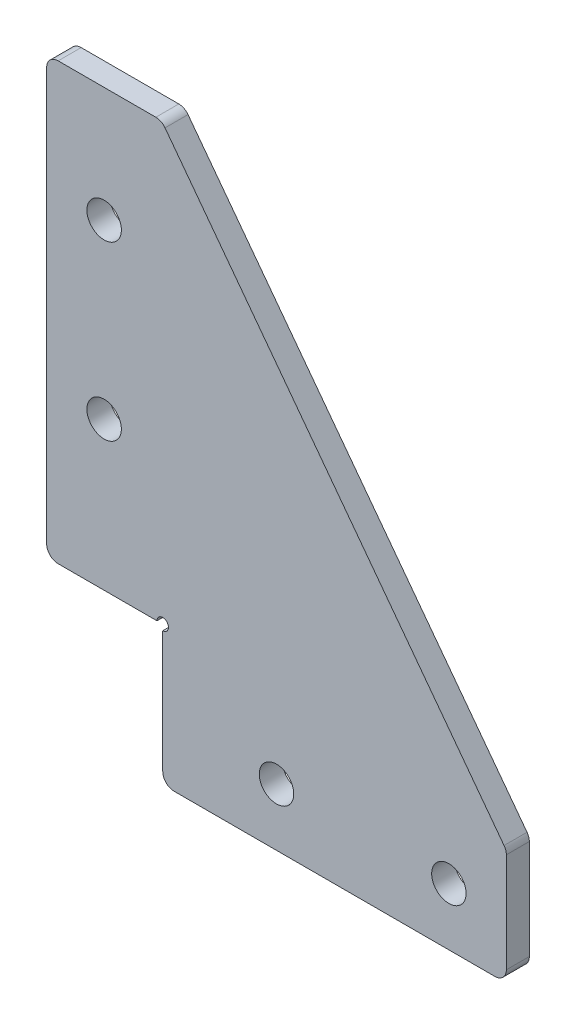
ISO-10303-21;
HEADER;
FILE_DESCRIPTION(('STEP AP214'),'2;1');
FILE_NAME('part.step','',(''),(''),'','','');
FILE_SCHEMA(('AUTOMOTIVE_DESIGN { 1 0 10303 214 1 1 1 1 }'));
ENDSEC;
DATA;
#1=APPLICATION_CONTEXT('core data for automotive mechanical design processes');
#2=APPLICATION_PROTOCOL_DEFINITION('international standard','automotive_design',2000,#1);
#3=PRODUCT_CONTEXT('',#1,'mechanical');
#4=PRODUCT('Part','Part','',(#3));
#5=PRODUCT_RELATED_PRODUCT_CATEGORY('part','',(#4));
#6=PRODUCT_DEFINITION_FORMATION('','',#4);
#7=PRODUCT_DEFINITION_CONTEXT('part definition',#1,'design');
#8=PRODUCT_DEFINITION('design','',#6,#7);
#9=PRODUCT_DEFINITION_SHAPE('','',#8);
#10=(LENGTH_UNIT() NAMED_UNIT(*) SI_UNIT(.MILLI.,.METRE.));
#11=(NAMED_UNIT(*) PLANE_ANGLE_UNIT() SI_UNIT($,.RADIAN.));
#12=(NAMED_UNIT(*) SI_UNIT($,.STERADIAN.) SOLID_ANGLE_UNIT());
#13=UNCERTAINTY_MEASURE_WITH_UNIT(LENGTH_MEASURE(1.E-05),#10,'distance_accuracy_value','');
#14=(GEOMETRIC_REPRESENTATION_CONTEXT(3) GLOBAL_UNCERTAINTY_ASSIGNED_CONTEXT((#13)) GLOBAL_UNIT_ASSIGNED_CONTEXT((#10,
#11,#12)) REPRESENTATION_CONTEXT('',''));
#15=CARTESIAN_POINT('',(0.,0.,0.));
#16=DIRECTION('',(0.,0.,1.));
#17=DIRECTION('',(1.,0.,0.));
#18=AXIS2_PLACEMENT_3D('',#15,#16,#17);
#19=CARTESIAN_POINT('',(0.,0.,2.));
#20=DIRECTION('',(0.,0.,-1.));
#21=DIRECTION('',(-1.,0.,0.));
#22=AXIS2_PLACEMENT_3D('',#19,#20,#21);
#23=PLANE('',#22);
#24=DIRECTION('',(-1.,0.,0.));
#25=VECTOR('',#24,1.);
#26=CARTESIAN_POINT('',(-5.,45.,2.));
#27=LINE('',#26,#25);
#28=CARTESIAN_POINT('',(4.50000000000001,45.,2.));
#29=VERTEX_POINT('',#28);
#30=CARTESIAN_POINT('',(-3.99999999999967,45.,2.));
#31=VERTEX_POINT('',#30);
#32=EDGE_CURVE('E207',#29,#31,#27,.T.);
#33=ORIENTED_EDGE('',*,*,#32,.T.);
#34=CARTESIAN_POINT('',(-3.99999999999967,44.,2.));
#35=DIRECTION('',(0.,0.,-1.));
#36=DIRECTION('',(-1.,0.,0.));
#37=AXIS2_PLACEMENT_3D('',#34,#35,#36);
#38=CIRCLE('',#37,1.);
#39=CARTESIAN_POINT('',(-5.,44.,2.));
#40=VERTEX_POINT('',#39);
#41=EDGE_CURVE('E256',#31,#40,#38,.F.);
#42=ORIENTED_EDGE('',*,*,#41,.T.);
#43=DIRECTION('',(0.,-1.,0.));
#44=VECTOR('',#43,1.);
#45=CARTESIAN_POINT('',(-4.99999999999995,15.,2.));
#46=LINE('',#45,#44);
#47=CARTESIAN_POINT('',(-4.99999999999994,8.10000000000001,2.));
#48=VERTEX_POINT('',#47);
#49=EDGE_CURVE('E155',#40,#48,#46,.T.);
#50=ORIENTED_EDGE('',*,*,#49,.T.);
#51=CARTESIAN_POINT('',(-4.00000000000002,8.1,2.));
#52=DIRECTION('',(0.,0.,-1.));
#53=DIRECTION('',(-1.,0.,0.));
#54=AXIS2_PLACEMENT_3D('',#51,#52,#53);
#55=CIRCLE('',#54,1.);
#56=CARTESIAN_POINT('',(-4.00000000000002,7.1,2.));
#57=VERTEX_POINT('',#56);
#58=EDGE_CURVE('E150',#48,#57,#55,.F.);
#59=ORIENTED_EDGE('',*,*,#58,.T.);
#60=DIRECTION('',(1.,0.,0.));
#61=VECTOR('',#60,1.);
#62=CARTESIAN_POINT('',(-5.00000000000002,7.1,2.));
#63=LINE('',#62,#61);
#64=CARTESIAN_POINT('',(4.59999999999999,7.09999999999999,2.));
#65=VERTEX_POINT('',#64);
#66=EDGE_CURVE('E141',#57,#65,#63,.T.);
#67=ORIENTED_EDGE('',*,*,#66,.T.);
#68=CARTESIAN_POINT('',(5.1,7.1,2.));
#69=DIRECTION('',(0.,0.,1.));
#70=DIRECTION('',(1.,0.,0.));
#71=AXIS2_PLACEMENT_3D('',#68,#69,#70);
#72=CIRCLE('',#71,0.500000000000001);
#73=CARTESIAN_POINT('',(5.09999999999997,6.59999999999999,2.));
#74=VERTEX_POINT('',#73);
#75=EDGE_CURVE('E146',#74,#65,#72,.T.);
#76=ORIENTED_EDGE('',*,*,#75,.F.);
#77=DIRECTION('',(0.,-1.,0.));
#78=VECTOR('',#77,1.);
#79=CARTESIAN_POINT('',(5.09999999999997,7.09999999999999,2.));
#80=LINE('',#79,#78);
#81=CARTESIAN_POINT('',(5.09999999999997,-4.,2.));
#82=VERTEX_POINT('',#81);
#83=EDGE_CURVE('E154',#74,#82,#80,.T.);
#84=ORIENTED_EDGE('',*,*,#83,.T.);
#85=CARTESIAN_POINT('',(6.09999999999997,-4.,2.));
#86=DIRECTION('',(0.,0.,-1.));
#87=DIRECTION('',(-1.,0.,0.));
#88=AXIS2_PLACEMENT_3D('',#85,#86,#87);
#89=CIRCLE('',#88,1.);
#90=CARTESIAN_POINT('',(6.09999999999997,-5.00000000000001,2.));
#91=VERTEX_POINT('',#90);
#92=EDGE_CURVE('E249',#82,#91,#89,.F.);
#93=ORIENTED_EDGE('',*,*,#92,.T.);
#94=DIRECTION('',(1.,0.,0.));
#95=VECTOR('',#94,1.);
#96=CARTESIAN_POINT('',(5.09999999999997,-5.00000000000001,2.));
#97=LINE('',#96,#95);
#98=CARTESIAN_POINT('',(34.,-5.,2.));
#99=VERTEX_POINT('',#98);
#100=EDGE_CURVE('E200',#91,#99,#97,.T.);
#101=ORIENTED_EDGE('',*,*,#100,.T.);
#102=CARTESIAN_POINT('',(34.,-4.,2.));
#103=DIRECTION('',(0.,0.,-1.));
#104=DIRECTION('',(-1.,0.,0.));
#105=AXIS2_PLACEMENT_3D('',#102,#103,#104);
#106=CIRCLE('',#105,1.);
#107=CARTESIAN_POINT('',(35.,-4.,2.));
#108=VERTEX_POINT('',#107);
#109=EDGE_CURVE('E251',#99,#108,#106,.F.);
#110=ORIENTED_EDGE('',*,*,#109,.T.);
#111=DIRECTION('',(0.,1.,0.));
#112=VECTOR('',#111,1.);
#113=CARTESIAN_POINT('',(35.,4.99999999999999,2.));
#114=LINE('',#113,#112);
#115=CARTESIAN_POINT('',(35.,4.66666666666666,2.));
#116=VERTEX_POINT('',#115);
#117=EDGE_CURVE('E203',#108,#116,#114,.T.);
#118=ORIENTED_EDGE('',*,*,#117,.T.);
#119=CARTESIAN_POINT('',(34.,4.66666666666666,2.));
#120=DIRECTION('',(0.,0.,-1.));
#121=DIRECTION('',(-1.,0.,0.));
#122=AXIS2_PLACEMENT_3D('',#119,#120,#121);
#123=CIRCLE('',#122,1.);
#124=CARTESIAN_POINT('',(34.8,5.26666666666666,2.));
#125=VERTEX_POINT('',#124);
#126=EDGE_CURVE('E61',#116,#125,#123,.F.);
#127=ORIENTED_EDGE('',*,*,#126,.T.);
#128=DIRECTION('',(-0.6,0.8,0.));
#129=VECTOR('',#128,1.);
#130=CARTESIAN_POINT('',(5.,45.,2.));
#131=LINE('',#130,#129);
#132=CARTESIAN_POINT('',(5.30000000000001,44.6,2.));
#133=VERTEX_POINT('',#132);
#134=EDGE_CURVE('E205',#125,#133,#131,.T.);
#135=ORIENTED_EDGE('',*,*,#134,.T.);
#136=CARTESIAN_POINT('',(4.50000000000001,44.,2.));
#137=DIRECTION('',(0.,0.,-1.));
#138=DIRECTION('',(-1.,0.,0.));
#139=AXIS2_PLACEMENT_3D('',#136,#137,#138);
#140=CIRCLE('',#139,1.);
#141=EDGE_CURVE('E254',#133,#29,#140,.F.);
#142=ORIENTED_EDGE('',*,*,#141,.T.);
#143=EDGE_LOOP('',(#33,#42,#50,#59,#67,#76,#84,#93,#101,#110,#118,#127,#135,#142));
#144=FACE_BOUND('',#143,.T.);
#145=CARTESIAN_POINT('',(0.,35.,2.));
#146=DIRECTION('',(0.,0.,1.));
#147=DIRECTION('',(1.,0.,0.));
#148=AXIS2_PLACEMENT_3D('',#145,#146,#147);
#149=CIRCLE('',#148,1.50000000000002);
#150=CARTESIAN_POINT('',(1.50000000000002,35.,2.));
#151=VERTEX_POINT('',#150);
#152=EDGE_CURVE('E191',#151,#151,#149,.T.);
#153=ORIENTED_EDGE('',*,*,#152,.F.);
#154=EDGE_LOOP('',(#153));
#155=FACE_BOUND('',#154,.T.);
#156=CARTESIAN_POINT('',(30.0000000000001,0.,2.));
#157=DIRECTION('',(0.,0.,1.));
#158=DIRECTION('',(1.,0.,0.));
#159=AXIS2_PLACEMENT_3D('',#156,#157,#158);
#160=CIRCLE('',#159,1.50000000000003);
#161=CARTESIAN_POINT('',(31.5000000000001,0.,2.));
#162=VERTEX_POINT('',#161);
#163=EDGE_CURVE('E185',#162,#162,#160,.T.);
#164=ORIENTED_EDGE('',*,*,#163,.F.);
#165=EDGE_LOOP('',(#164));
#166=FACE_BOUND('',#165,.T.);
#167=CARTESIAN_POINT('',(0.,20.,2.));
#168=DIRECTION('',(0.,0.,1.));
#169=DIRECTION('',(1.,0.,0.));
#170=AXIS2_PLACEMENT_3D('',#167,#168,#169);
#171=CIRCLE('',#170,1.50000000000002);
#172=CARTESIAN_POINT('',(1.50000000000002,20.,2.));
#173=VERTEX_POINT('',#172);
#174=EDGE_CURVE('E179',#173,#173,#171,.T.);
#175=ORIENTED_EDGE('',*,*,#174,.F.);
#176=EDGE_LOOP('',(#175));
#177=FACE_BOUND('',#176,.T.);
#178=CARTESIAN_POINT('',(15.0000000000001,0.,2.));
#179=DIRECTION('',(0.,0.,1.));
#180=DIRECTION('',(1.,0.,0.));
#181=AXIS2_PLACEMENT_3D('',#178,#179,#180);
#182=CIRCLE('',#181,1.50000000000003);
#183=CARTESIAN_POINT('',(16.5000000000001,0.,2.));
#184=VERTEX_POINT('',#183);
#185=EDGE_CURVE('E172',#184,#184,#182,.T.);
#186=ORIENTED_EDGE('',*,*,#185,.F.);
#187=EDGE_LOOP('',(#186));
#188=FACE_BOUND('',#187,.T.);
#189=ADVANCED_FACE('F39',(#144,#155,#166,#177,#188),#23,.F.);
#190=CARTESIAN_POINT('',(0.,0.,0.));
#191=DIRECTION('',(0.,0.,-1.));
#192=DIRECTION('',(-1.,0.,0.));
#193=AXIS2_PLACEMENT_3D('',#190,#191,#192);
#194=PLANE('',#193);
#195=DIRECTION('',(0.,-1.,0.));
#196=VECTOR('',#195,1.);
#197=CARTESIAN_POINT('',(-4.99999999999995,15.,0.));
#198=LINE('',#197,#196);
#199=CARTESIAN_POINT('',(-4.99999999999967,44.,0.));
#200=VERTEX_POINT('',#199);
#201=CARTESIAN_POINT('',(-5.00000000000002,8.10000000000001,0.));
#202=VERTEX_POINT('',#201);
#203=EDGE_CURVE('E194',#200,#202,#198,.T.);
#204=ORIENTED_EDGE('',*,*,#203,.F.);
#205=CARTESIAN_POINT('',(-3.99999999999967,44.,0.));
#206=DIRECTION('',(0.,0.,-1.));
#207=DIRECTION('',(-1.,0.,0.));
#208=AXIS2_PLACEMENT_3D('',#205,#206,#207);
#209=CIRCLE('',#208,1.);
#210=CARTESIAN_POINT('',(-3.99999999999967,45.,0.));
#211=VERTEX_POINT('',#210);
#212=EDGE_CURVE('E241',#200,#211,#209,.T.);
#213=ORIENTED_EDGE('',*,*,#212,.T.);
#214=DIRECTION('',(-1.,0.,0.));
#215=VECTOR('',#214,1.);
#216=CARTESIAN_POINT('',(-5.,45.,0.));
#217=LINE('',#216,#215);
#218=CARTESIAN_POINT('',(4.50000000000001,45.,0.));
#219=VERTEX_POINT('',#218);
#220=EDGE_CURVE('E197',#219,#211,#217,.T.);
#221=ORIENTED_EDGE('',*,*,#220,.F.);
#222=CARTESIAN_POINT('',(4.50000000000001,44.,0.));
#223=DIRECTION('',(0.,0.,-1.));
#224=DIRECTION('',(-1.,0.,0.));
#225=AXIS2_PLACEMENT_3D('',#222,#223,#224);
#226=CIRCLE('',#225,1.);
#227=CARTESIAN_POINT('',(5.30000000000001,44.6,0.));
#228=VERTEX_POINT('',#227);
#229=EDGE_CURVE('E239',#219,#228,#226,.T.);
#230=ORIENTED_EDGE('',*,*,#229,.T.);
#231=DIRECTION('',(-0.6,0.8,0.));
#232=VECTOR('',#231,1.);
#233=CARTESIAN_POINT('',(5.,45.,0.));
#234=LINE('',#233,#232);
#235=CARTESIAN_POINT('',(34.8,5.26666666666666,0.));
#236=VERTEX_POINT('',#235);
#237=EDGE_CURVE('E221',#236,#228,#234,.T.);
#238=ORIENTED_EDGE('',*,*,#237,.F.);
#239=CARTESIAN_POINT('',(34.,4.66666666666666,0.));
#240=DIRECTION('',(0.,0.,-1.));
#241=DIRECTION('',(-1.,0.,0.));
#242=AXIS2_PLACEMENT_3D('',#239,#240,#241);
#243=CIRCLE('',#242,1.);
#244=CARTESIAN_POINT('',(35.,4.66666666666666,0.));
#245=VERTEX_POINT('',#244);
#246=EDGE_CURVE('E237',#236,#245,#243,.T.);
#247=ORIENTED_EDGE('',*,*,#246,.T.);
#248=DIRECTION('',(0.,1.,0.));
#249=VECTOR('',#248,1.);
#250=CARTESIAN_POINT('',(35.,4.99999999999999,0.));
#251=LINE('',#250,#249);
#252=CARTESIAN_POINT('',(35.,-4.,0.));
#253=VERTEX_POINT('',#252);
#254=EDGE_CURVE('E218',#253,#245,#251,.T.);
#255=ORIENTED_EDGE('',*,*,#254,.F.);
#256=CARTESIAN_POINT('',(34.,-4.,0.));
#257=DIRECTION('',(0.,0.,-1.));
#258=DIRECTION('',(-1.,0.,0.));
#259=AXIS2_PLACEMENT_3D('',#256,#257,#258);
#260=CIRCLE('',#259,1.);
#261=CARTESIAN_POINT('',(34.,-5.,0.));
#262=VERTEX_POINT('',#261);
#263=EDGE_CURVE('E235',#253,#262,#260,.T.);
#264=ORIENTED_EDGE('',*,*,#263,.T.);
#265=DIRECTION('',(1.,0.,0.));
#266=VECTOR('',#265,1.);
#267=CARTESIAN_POINT('',(35.,-5.,0.));
#268=LINE('',#267,#266);
#269=CARTESIAN_POINT('',(6.09999999999997,-5.,0.));
#270=VERTEX_POINT('',#269);
#271=EDGE_CURVE('E215',#270,#262,#268,.T.);
#272=ORIENTED_EDGE('',*,*,#271,.F.);
#273=CARTESIAN_POINT('',(6.09999999999997,-4.,0.));
#274=DIRECTION('',(0.,0.,-1.));
#275=DIRECTION('',(-1.,0.,0.));
#276=AXIS2_PLACEMENT_3D('',#273,#274,#275);
#277=CIRCLE('',#276,1.);
#278=CARTESIAN_POINT('',(5.09999999999997,-4.,0.));
#279=VERTEX_POINT('',#278);
#280=EDGE_CURVE('E233',#270,#279,#277,.T.);
#281=ORIENTED_EDGE('',*,*,#280,.T.);
#282=DIRECTION('',(0.,-1.,0.));
#283=VECTOR('',#282,1.);
#284=CARTESIAN_POINT('',(5.09999999999997,7.09999999999999,0.));
#285=LINE('',#284,#283);
#286=CARTESIAN_POINT('',(5.09999999999997,6.59999999999999,0.));
#287=VERTEX_POINT('',#286);
#288=EDGE_CURVE('E212',#287,#279,#285,.T.);
#289=ORIENTED_EDGE('',*,*,#288,.F.);
#290=CARTESIAN_POINT('',(5.1,7.1,0.));
#291=DIRECTION('',(0.,0.,-1.));
#292=DIRECTION('',(-1.,0.,0.));
#293=AXIS2_PLACEMENT_3D('',#290,#291,#292);
#294=CIRCLE('',#293,0.500000000000001);
#295=CARTESIAN_POINT('',(4.59999999999999,7.09999999999999,0.));
#296=VERTEX_POINT('',#295);
#297=EDGE_CURVE('E164',#296,#287,#294,.T.);
#298=ORIENTED_EDGE('',*,*,#297,.F.);
#299=DIRECTION('',(1.,0.,0.));
#300=VECTOR('',#299,1.);
#301=CARTESIAN_POINT('',(-5.00000000000002,7.1,0.));
#302=LINE('',#301,#300);
#303=CARTESIAN_POINT('',(-4.00000000000002,7.1,0.));
#304=VERTEX_POINT('',#303);
#305=EDGE_CURVE('E168',#304,#296,#302,.T.);
#306=ORIENTED_EDGE('',*,*,#305,.F.);
#307=CARTESIAN_POINT('',(-4.00000000000002,8.1,0.));
#308=DIRECTION('',(0.,0.,-1.));
#309=DIRECTION('',(-1.,0.,0.));
#310=AXIS2_PLACEMENT_3D('',#307,#308,#309);
#311=CIRCLE('',#310,1.);
#312=EDGE_CURVE('E231',#304,#202,#311,.T.);
#313=ORIENTED_EDGE('',*,*,#312,.T.);
#314=EDGE_LOOP('',(#204,#213,#221,#230,#238,#247,#255,#264,#272,#281,#289,#298,#306,#313));
#315=FACE_BOUND('',#314,.T.);
#316=CARTESIAN_POINT('',(0.,20.,0.));
#317=DIRECTION('',(0.,0.,1.));
#318=DIRECTION('',(1.,0.,0.));
#319=AXIS2_PLACEMENT_3D('',#316,#317,#318);
#320=CIRCLE('',#319,1.50000000000002);
#321=CARTESIAN_POINT('',(1.50000000000002,20.,0.));
#322=VERTEX_POINT('',#321);
#323=EDGE_CURVE('E177',#322,#322,#320,.T.);
#324=ORIENTED_EDGE('',*,*,#323,.T.);
#325=EDGE_LOOP('',(#324));
#326=FACE_BOUND('',#325,.T.);
#327=CARTESIAN_POINT('',(0.,35.,0.));
#328=DIRECTION('',(0.,0.,1.));
#329=DIRECTION('',(1.,0.,0.));
#330=AXIS2_PLACEMENT_3D('',#327,#328,#329);
#331=CIRCLE('',#330,1.50000000000002);
#332=CARTESIAN_POINT('',(1.50000000000002,35.,0.));
#333=VERTEX_POINT('',#332);
#334=EDGE_CURVE('E188',#333,#333,#331,.T.);
#335=ORIENTED_EDGE('',*,*,#334,.T.);
#336=EDGE_LOOP('',(#335));
#337=FACE_BOUND('',#336,.T.);
#338=CARTESIAN_POINT('',(30.0000000000001,0.,0.));
#339=DIRECTION('',(0.,0.,1.));
#340=DIRECTION('',(1.,0.,0.));
#341=AXIS2_PLACEMENT_3D('',#338,#339,#340);
#342=CIRCLE('',#341,1.50000000000003);
#343=CARTESIAN_POINT('',(31.5000000000001,0.,0.));
#344=VERTEX_POINT('',#343);
#345=EDGE_CURVE('E182',#344,#344,#342,.T.);
#346=ORIENTED_EDGE('',*,*,#345,.T.);
#347=EDGE_LOOP('',(#346));
#348=FACE_BOUND('',#347,.T.);
#349=CARTESIAN_POINT('',(15.0000000000001,0.,0.));
#350=DIRECTION('',(0.,0.,1.));
#351=DIRECTION('',(1.,0.,0.));
#352=AXIS2_PLACEMENT_3D('',#349,#350,#351);
#353=CIRCLE('',#352,1.50000000000003);
#354=CARTESIAN_POINT('',(16.5000000000001,0.,0.));
#355=VERTEX_POINT('',#354);
#356=EDGE_CURVE('E169',#355,#355,#353,.T.);
#357=ORIENTED_EDGE('',*,*,#356,.T.);
#358=EDGE_LOOP('',(#357));
#359=FACE_BOUND('',#358,.T.);
#360=ADVANCED_FACE('F286',(#315,#326,#337,#348,#359),#194,.T.);
#361=CARTESIAN_POINT('',(-4.99999999999995,15.,2.));
#362=DIRECTION('',(1.,0.,0.));
#363=DIRECTION('',(0.,1.,0.));
#364=AXIS2_PLACEMENT_3D('',#361,#362,#363);
#365=PLANE('',#364);
#366=ORIENTED_EDGE('',*,*,#49,.F.);
#367=DIRECTION('',(0.,0.,-1.));
#368=VECTOR('',#367,1.);
#369=CARTESIAN_POINT('',(-4.99999999999967,44.,2.));
#370=LINE('',#369,#368);
#371=EDGE_CURVE('E228',#40,#200,#370,.T.);
#372=ORIENTED_EDGE('',*,*,#371,.T.);
#373=ORIENTED_EDGE('',*,*,#203,.T.);
#374=DIRECTION('',(0.,0.,-1.));
#375=VECTOR('',#374,1.);
#376=CARTESIAN_POINT('',(-5.00000000000002,8.10000000000001,2.));
#377=LINE('',#376,#375);
#378=EDGE_CURVE('E226',#202,#48,#377,.F.);
#379=ORIENTED_EDGE('',*,*,#378,.T.);
#380=EDGE_LOOP('',(#366,#372,#373,#379));
#381=FACE_BOUND('',#380,.T.);
#382=ADVANCED_FACE('F317',(#381),#365,.F.);
#383=CARTESIAN_POINT('',(-5.00000000000002,7.1,2.));
#384=DIRECTION('',(0.,1.,0.));
#385=DIRECTION('',(-1.,0.,0.));
#386=AXIS2_PLACEMENT_3D('',#383,#384,#385);
#387=PLANE('',#386);
#388=ORIENTED_EDGE('',*,*,#66,.F.);
#389=DIRECTION('',(0.,0.,-1.));
#390=VECTOR('',#389,1.);
#391=CARTESIAN_POINT('',(-4.00000000000002,7.1,2.));
#392=LINE('',#391,#390);
#393=EDGE_CURVE('E11',#57,#304,#392,.T.);
#394=ORIENTED_EDGE('',*,*,#393,.T.);
#395=ORIENTED_EDGE('',*,*,#305,.T.);
#396=DIRECTION('',(0.,0.,1.));
#397=VECTOR('',#396,1.);
#398=CARTESIAN_POINT('',(4.59999999999999,7.09999999999999,-8.));
#399=LINE('',#398,#397);
#400=EDGE_CURVE('E160',#296,#65,#399,.T.);
#401=ORIENTED_EDGE('',*,*,#400,.T.);
#402=EDGE_LOOP('',(#388,#394,#395,#401));
#403=FACE_BOUND('',#402,.T.);
#404=ADVANCED_FACE('F166',(#403),#387,.F.);
#405=CARTESIAN_POINT('',(5.09999999999997,7.09999999999999,2.));
#406=DIRECTION('',(1.,0.,0.));
#407=DIRECTION('',(0.,1.,0.));
#408=AXIS2_PLACEMENT_3D('',#405,#406,#407);
#409=PLANE('',#408);
#410=ORIENTED_EDGE('',*,*,#288,.T.);
#411=DIRECTION('',(0.,0.,-1.));
#412=VECTOR('',#411,1.);
#413=CARTESIAN_POINT('',(5.09999999999997,-4.,2.));
#414=LINE('',#413,#412);
#415=EDGE_CURVE('E47',#279,#82,#414,.F.);
#416=ORIENTED_EDGE('',*,*,#415,.T.);
#417=ORIENTED_EDGE('',*,*,#83,.F.);
#418=DIRECTION('',(0.,0.,1.));
#419=VECTOR('',#418,1.);
#420=CARTESIAN_POINT('',(5.09999999999997,6.59999999999999,-8.));
#421=LINE('',#420,#419);
#422=EDGE_CURVE('E163',#74,#287,#421,.F.);
#423=ORIENTED_EDGE('',*,*,#422,.T.);
#424=EDGE_LOOP('',(#410,#416,#417,#423));
#425=FACE_BOUND('',#424,.T.);
#426=ADVANCED_FACE('F273',(#425),#409,.F.);
#427=CARTESIAN_POINT('',(35.,-5.,2.));
#428=DIRECTION('',(0.,1.,0.));
#429=DIRECTION('',(0.,0.,1.));
#430=AXIS2_PLACEMENT_3D('',#427,#428,#429);
#431=PLANE('',#430);
#432=ORIENTED_EDGE('',*,*,#271,.T.);
#433=DIRECTION('',(0.,0.,-1.));
#434=VECTOR('',#433,1.);
#435=CARTESIAN_POINT('',(34.,-5.,2.));
#436=LINE('',#435,#434);
#437=EDGE_CURVE('E270',#262,#99,#436,.F.);
#438=ORIENTED_EDGE('',*,*,#437,.T.);
#439=ORIENTED_EDGE('',*,*,#100,.F.);
#440=DIRECTION('',(0.,0.,-1.));
#441=VECTOR('',#440,1.);
#442=CARTESIAN_POINT('',(6.09999999999997,-5.,2.));
#443=LINE('',#442,#441);
#444=EDGE_CURVE('E267',#91,#270,#443,.T.);
#445=ORIENTED_EDGE('',*,*,#444,.T.);
#446=EDGE_LOOP('',(#432,#438,#439,#445));
#447=FACE_BOUND('',#446,.T.);
#448=ADVANCED_FACE('F282',(#447),#431,.F.);
#449=CARTESIAN_POINT('',(35.,4.99999999999999,2.));
#450=DIRECTION('',(-1.,0.,0.));
#451=DIRECTION('',(0.,0.,1.));
#452=AXIS2_PLACEMENT_3D('',#449,#450,#451);
#453=PLANE('',#452);
#454=ORIENTED_EDGE('',*,*,#254,.T.);
#455=DIRECTION('',(0.,0.,-1.));
#456=VECTOR('',#455,1.);
#457=CARTESIAN_POINT('',(35.,4.66666666666666,2.));
#458=LINE('',#457,#456);
#459=EDGE_CURVE('E265',#245,#116,#458,.F.);
#460=ORIENTED_EDGE('',*,*,#459,.T.);
#461=ORIENTED_EDGE('',*,*,#117,.F.);
#462=DIRECTION('',(0.,0.,-1.));
#463=VECTOR('',#462,1.);
#464=CARTESIAN_POINT('',(35.,-4.,2.));
#465=LINE('',#464,#463);
#466=EDGE_CURVE('E262',#108,#253,#465,.T.);
#467=ORIENTED_EDGE('',*,*,#466,.T.);
#468=EDGE_LOOP('',(#454,#460,#461,#467));
#469=FACE_BOUND('',#468,.T.);
#470=ADVANCED_FACE('F295',(#469),#453,.F.);
#471=CARTESIAN_POINT('',(5.,45.,2.));
#472=DIRECTION('',(-0.8,-0.6,0.));
#473=DIRECTION('',(0.6,-0.8,0.));
#474=AXIS2_PLACEMENT_3D('',#471,#472,#473);
#475=PLANE('',#474);
#476=ORIENTED_EDGE('',*,*,#237,.T.);
#477=DIRECTION('',(0.,0.,-1.));
#478=VECTOR('',#477,1.);
#479=CARTESIAN_POINT('',(5.30000000000001,44.6,2.));
#480=LINE('',#479,#478);
#481=EDGE_CURVE('E54',#228,#133,#480,.F.);
#482=ORIENTED_EDGE('',*,*,#481,.T.);
#483=ORIENTED_EDGE('',*,*,#134,.F.);
#484=DIRECTION('',(0.,0.,-1.));
#485=VECTOR('',#484,1.);
#486=CARTESIAN_POINT('',(34.8,5.26666666666666,2.));
#487=LINE('',#486,#485);
#488=EDGE_CURVE('E258',#125,#236,#487,.T.);
#489=ORIENTED_EDGE('',*,*,#488,.T.);
#490=EDGE_LOOP('',(#476,#482,#483,#489));
#491=FACE_BOUND('',#490,.T.);
#492=ADVANCED_FACE('F301',(#491),#475,.F.);
#493=CARTESIAN_POINT('',(-5.,45.,2.));
#494=DIRECTION('',(0.,-1.,0.));
#495=DIRECTION('',(1.,0.,0.));
#496=AXIS2_PLACEMENT_3D('',#493,#494,#495);
#497=PLANE('',#496);
#498=ORIENTED_EDGE('',*,*,#220,.T.);
#499=DIRECTION('',(0.,0.,-1.));
#500=VECTOR('',#499,1.);
#501=CARTESIAN_POINT('',(-3.99999999999967,45.,2.));
#502=LINE('',#501,#500);
#503=EDGE_CURVE('E246',#211,#31,#502,.F.);
#504=ORIENTED_EDGE('',*,*,#503,.T.);
#505=ORIENTED_EDGE('',*,*,#32,.F.);
#506=DIRECTION('',(0.,0.,-1.));
#507=VECTOR('',#506,1.);
#508=CARTESIAN_POINT('',(4.50000000000001,45.,2.));
#509=LINE('',#508,#507);
#510=EDGE_CURVE('E243',#29,#219,#509,.T.);
#511=ORIENTED_EDGE('',*,*,#510,.T.);
#512=EDGE_LOOP('',(#498,#504,#505,#511));
#513=FACE_BOUND('',#512,.T.);
#514=ADVANCED_FACE('F309',(#513),#497,.F.);
#515=CARTESIAN_POINT('',(0.,35.,2.));
#516=DIRECTION('',(0.,0.,-1.));
#517=DIRECTION('',(-1.,0.,0.));
#518=AXIS2_PLACEMENT_3D('',#515,#516,#517);
#519=CYLINDRICAL_SURFACE('',#518,1.50000000000002);
#520=ORIENTED_EDGE('',*,*,#152,.T.);
#521=EDGE_LOOP('',(#520));
#522=FACE_BOUND('',#521,.T.);
#523=ORIENTED_EDGE('',*,*,#334,.F.);
#524=EDGE_LOOP('',(#523));
#525=FACE_BOUND('',#524,.T.);
#526=ADVANCED_FACE('F332',(#522,#525),#519,.F.);
#527=CARTESIAN_POINT('',(30.0000000000001,0.,2.));
#528=DIRECTION('',(0.,0.,-1.));
#529=DIRECTION('',(-1.,0.,0.));
#530=AXIS2_PLACEMENT_3D('',#527,#528,#529);
#531=CYLINDRICAL_SURFACE('',#530,1.50000000000003);
#532=ORIENTED_EDGE('',*,*,#163,.T.);
#533=EDGE_LOOP('',(#532));
#534=FACE_BOUND('',#533,.T.);
#535=ORIENTED_EDGE('',*,*,#345,.F.);
#536=EDGE_LOOP('',(#535));
#537=FACE_BOUND('',#536,.T.);
#538=ADVANCED_FACE('F420',(#534,#537),#531,.F.);
#539=CARTESIAN_POINT('',(0.,20.,2.));
#540=DIRECTION('',(0.,0.,-1.));
#541=DIRECTION('',(-1.,0.,0.));
#542=AXIS2_PLACEMENT_3D('',#539,#540,#541);
#543=CYLINDRICAL_SURFACE('',#542,1.50000000000002);
#544=ORIENTED_EDGE('',*,*,#174,.T.);
#545=EDGE_LOOP('',(#544));
#546=FACE_BOUND('',#545,.T.);
#547=ORIENTED_EDGE('',*,*,#323,.F.);
#548=EDGE_LOOP('',(#547));
#549=FACE_BOUND('',#548,.T.);
#550=ADVANCED_FACE('F410',(#546,#549),#543,.F.);
#551=CARTESIAN_POINT('',(15.0000000000001,0.,2.));
#552=DIRECTION('',(0.,0.,-1.));
#553=DIRECTION('',(-1.,0.,0.));
#554=AXIS2_PLACEMENT_3D('',#551,#552,#553);
#555=CYLINDRICAL_SURFACE('',#554,1.50000000000003);
#556=ORIENTED_EDGE('',*,*,#185,.T.);
#557=EDGE_LOOP('',(#556));
#558=FACE_BOUND('',#557,.T.);
#559=ORIENTED_EDGE('',*,*,#356,.F.);
#560=EDGE_LOOP('',(#559));
#561=FACE_BOUND('',#560,.T.);
#562=ADVANCED_FACE('F402',(#558,#561),#555,.F.);
#563=CARTESIAN_POINT('',(5.1,7.1,-8.));
#564=DIRECTION('',(0.,0.,1.));
#565=DIRECTION('',(1.,0.,0.));
#566=AXIS2_PLACEMENT_3D('',#563,#564,#565);
#567=CYLINDRICAL_SURFACE('',#566,0.500000000000001);
#568=ORIENTED_EDGE('',*,*,#297,.T.);
#569=ORIENTED_EDGE('',*,*,#422,.F.);
#570=ORIENTED_EDGE('',*,*,#75,.T.);
#571=ORIENTED_EDGE('',*,*,#400,.F.);
#572=EDGE_LOOP('',(#568,#569,#570,#571));
#573=FACE_BOUND('',#572,.T.);
#574=ADVANCED_FACE('F159',(#573),#567,.F.);
#575=CARTESIAN_POINT('',(-3.99999999999967,44.,2.));
#576=DIRECTION('',(0.,0.,-1.));
#577=DIRECTION('',(-1.,0.,0.));
#578=AXIS2_PLACEMENT_3D('',#575,#576,#577);
#579=CYLINDRICAL_SURFACE('',#578,1.);
#580=ORIENTED_EDGE('',*,*,#41,.F.);
#581=ORIENTED_EDGE('',*,*,#503,.F.);
#582=ORIENTED_EDGE('',*,*,#212,.F.);
#583=ORIENTED_EDGE('',*,*,#371,.F.);
#584=EDGE_LOOP('',(#580,#581,#582,#583));
#585=FACE_BOUND('',#584,.T.);
#586=ADVANCED_FACE('F315',(#585),#579,.T.);
#587=CARTESIAN_POINT('',(4.50000000000001,44.,2.));
#588=DIRECTION('',(0.,0.,-1.));
#589=DIRECTION('',(-1.,0.,0.));
#590=AXIS2_PLACEMENT_3D('',#587,#588,#589);
#591=CYLINDRICAL_SURFACE('',#590,1.);
#592=ORIENTED_EDGE('',*,*,#141,.F.);
#593=ORIENTED_EDGE('',*,*,#481,.F.);
#594=ORIENTED_EDGE('',*,*,#229,.F.);
#595=ORIENTED_EDGE('',*,*,#510,.F.);
#596=EDGE_LOOP('',(#592,#593,#594,#595));
#597=FACE_BOUND('',#596,.T.);
#598=ADVANCED_FACE('F306',(#597),#591,.T.);
#599=CARTESIAN_POINT('',(34.,4.66666666666666,2.));
#600=DIRECTION('',(0.,0.,-1.));
#601=DIRECTION('',(-1.,0.,0.));
#602=AXIS2_PLACEMENT_3D('',#599,#600,#601);
#603=CYLINDRICAL_SURFACE('',#602,1.);
#604=ORIENTED_EDGE('',*,*,#126,.F.);
#605=ORIENTED_EDGE('',*,*,#459,.F.);
#606=ORIENTED_EDGE('',*,*,#246,.F.);
#607=ORIENTED_EDGE('',*,*,#488,.F.);
#608=EDGE_LOOP('',(#604,#605,#606,#607));
#609=FACE_BOUND('',#608,.T.);
#610=ADVANCED_FACE('F299',(#609),#603,.T.);
#611=CARTESIAN_POINT('',(34.,-4.,2.));
#612=DIRECTION('',(0.,0.,-1.));
#613=DIRECTION('',(-1.,0.,0.));
#614=AXIS2_PLACEMENT_3D('',#611,#612,#613);
#615=CYLINDRICAL_SURFACE('',#614,1.);
#616=ORIENTED_EDGE('',*,*,#109,.F.);
#617=ORIENTED_EDGE('',*,*,#437,.F.);
#618=ORIENTED_EDGE('',*,*,#263,.F.);
#619=ORIENTED_EDGE('',*,*,#466,.F.);
#620=EDGE_LOOP('',(#616,#617,#618,#619));
#621=FACE_BOUND('',#620,.T.);
#622=ADVANCED_FACE('F292',(#621),#615,.T.);
#623=CARTESIAN_POINT('',(6.09999999999997,-4.,2.));
#624=DIRECTION('',(0.,0.,-1.));
#625=DIRECTION('',(-1.,0.,0.));
#626=AXIS2_PLACEMENT_3D('',#623,#624,#625);
#627=CYLINDRICAL_SURFACE('',#626,1.);
#628=ORIENTED_EDGE('',*,*,#92,.F.);
#629=ORIENTED_EDGE('',*,*,#415,.F.);
#630=ORIENTED_EDGE('',*,*,#280,.F.);
#631=ORIENTED_EDGE('',*,*,#444,.F.);
#632=EDGE_LOOP('',(#628,#629,#630,#631));
#633=FACE_BOUND('',#632,.T.);
#634=ADVANCED_FACE('F279',(#633),#627,.T.);
#635=CARTESIAN_POINT('',(-4.00000000000002,8.1,2.));
#636=DIRECTION('',(0.,0.,-1.));
#637=DIRECTION('',(-1.,0.,0.));
#638=AXIS2_PLACEMENT_3D('',#635,#636,#637);
#639=CYLINDRICAL_SURFACE('',#638,1.);
#640=ORIENTED_EDGE('',*,*,#58,.F.);
#641=ORIENTED_EDGE('',*,*,#378,.F.);
#642=ORIENTED_EDGE('',*,*,#312,.F.);
#643=ORIENTED_EDGE('',*,*,#393,.F.);
#644=EDGE_LOOP('',(#640,#641,#642,#643));
#645=FACE_BOUND('',#644,.T.);
#646=ADVANCED_FACE('F41',(#645),#639,.T.);
#647=CLOSED_SHELL('',(#189,#360,#382,#404,#426,#448,#470,#492,#514,#526,#538,#550,#562,#574,
#586,#598,#610,#622,#634,#646));
#648=MANIFOLD_SOLID_BREP('B2',#647);
#649=ADVANCED_BREP_SHAPE_REPRESENTATION('',(#18,#648),#14);
#650=SHAPE_DEFINITION_REPRESENTATION(#9,#649);
ENDSEC;
END-ISO-10303-21;
